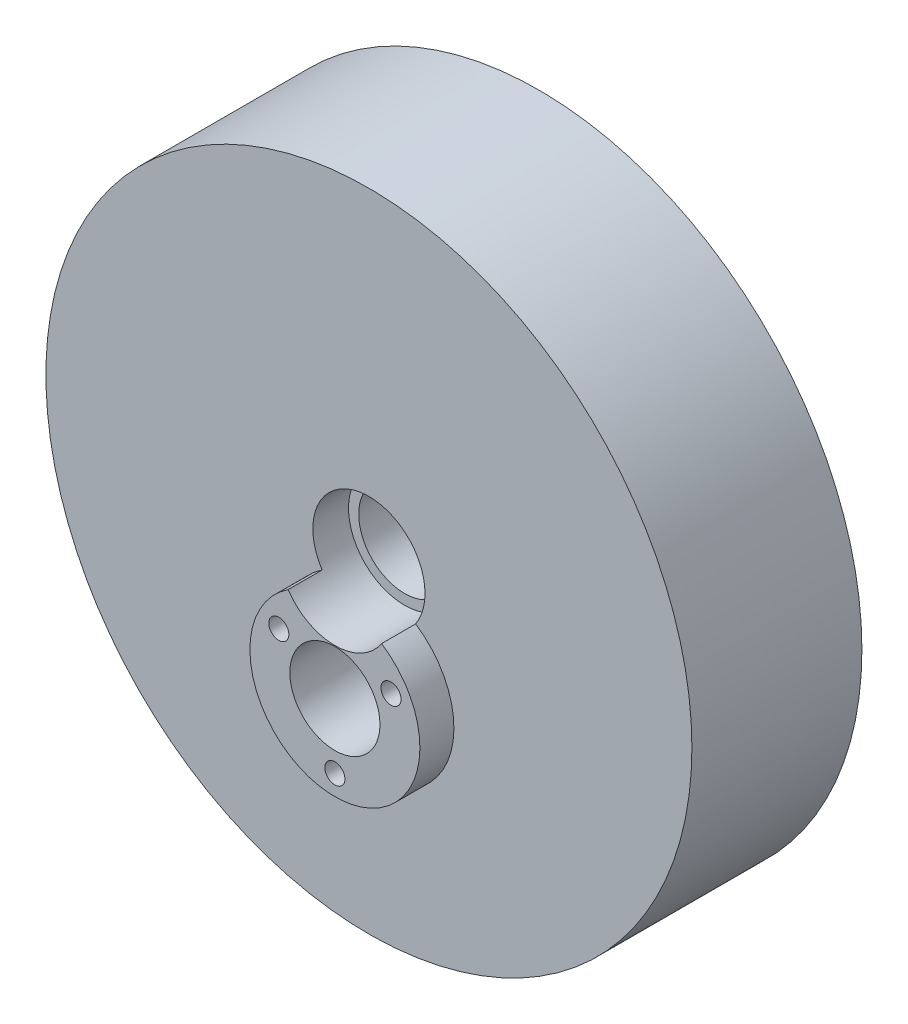
ISO-10303-21;
HEADER;
FILE_DESCRIPTION(('STEP AP214'),'2;1');
FILE_NAME('part.step','',(''),(''),'','','');
FILE_SCHEMA(('AUTOMOTIVE_DESIGN { 1 0 10303 214 1 1 1 1 }'));
ENDSEC;
DATA;
#1=APPLICATION_CONTEXT('core data for automotive mechanical design processes');
#2=APPLICATION_PROTOCOL_DEFINITION('international standard','automotive_design',2000,#1);
#3=PRODUCT_CONTEXT('',#1,'mechanical');
#4=PRODUCT('Part','Part','',(#3));
#5=PRODUCT_RELATED_PRODUCT_CATEGORY('part','',(#4));
#6=PRODUCT_DEFINITION_FORMATION('','',#4);
#7=PRODUCT_DEFINITION_CONTEXT('part definition',#1,'design');
#8=PRODUCT_DEFINITION('design','',#6,#7);
#9=PRODUCT_DEFINITION_SHAPE('','',#8);
#10=(LENGTH_UNIT() NAMED_UNIT(*) SI_UNIT(.MILLI.,.METRE.));
#11=(NAMED_UNIT(*) PLANE_ANGLE_UNIT() SI_UNIT($,.RADIAN.));
#12=(NAMED_UNIT(*) SI_UNIT($,.STERADIAN.) SOLID_ANGLE_UNIT());
#13=UNCERTAINTY_MEASURE_WITH_UNIT(LENGTH_MEASURE(1.E-05),#10,'distance_accuracy_value','');
#14=(GEOMETRIC_REPRESENTATION_CONTEXT(3) GLOBAL_UNCERTAINTY_ASSIGNED_CONTEXT((#13)) GLOBAL_UNIT_ASSIGNED_CONTEXT((#10,
#11,#12)) REPRESENTATION_CONTEXT('',''));
#15=CARTESIAN_POINT('',(0.,0.,0.));
#16=DIRECTION('',(0.,0.,1.));
#17=DIRECTION('',(1.,0.,0.));
#18=AXIS2_PLACEMENT_3D('',#15,#16,#17);
#19=CARTESIAN_POINT('',(0.,0.,25.4));
#20=DIRECTION('',(0.,0.,-1.));
#21=DIRECTION('',(-1.,0.,0.));
#22=AXIS2_PLACEMENT_3D('',#19,#20,#21);
#23=CYLINDRICAL_SURFACE('',#22,48.26);
#24=CARTESIAN_POINT('',(0.,0.,25.4));
#25=DIRECTION('',(0.,0.,1.));
#26=DIRECTION('',(1.,0.,0.));
#27=AXIS2_PLACEMENT_3D('',#24,#25,#26);
#28=CIRCLE('',#27,48.26);
#29=CARTESIAN_POINT('',(48.26,0.,25.4));
#30=VERTEX_POINT('',#29);
#31=EDGE_CURVE('E11',#30,#30,#28,.T.);
#32=ORIENTED_EDGE('',*,*,#31,.F.);
#33=EDGE_LOOP('',(#32));
#34=FACE_BOUND('',#33,.T.);
#35=CARTESIAN_POINT('',(0.,0.,0.));
#36=DIRECTION('',(0.,0.,1.));
#37=DIRECTION('',(1.,0.,0.));
#38=AXIS2_PLACEMENT_3D('',#35,#36,#37);
#39=CIRCLE('',#38,48.26);
#40=CARTESIAN_POINT('',(48.26,0.,0.));
#41=VERTEX_POINT('',#40);
#42=EDGE_CURVE('E47',#41,#41,#39,.T.);
#43=ORIENTED_EDGE('',*,*,#42,.T.);
#44=EDGE_LOOP('',(#43));
#45=FACE_BOUND('',#44,.T.);
#46=ADVANCED_FACE('F39',(#34,#45),#23,.T.);
#47=CARTESIAN_POINT('',(0.,0.,25.4));
#48=DIRECTION('',(0.,0.,1.));
#49=DIRECTION('',(1.,0.,0.));
#50=AXIS2_PLACEMENT_3D('',#47,#48,#49);
#51=PLANE('',#50);
#52=CARTESIAN_POINT('',(0.,-15.24,25.4));
#53=DIRECTION('',(0.,0.,1.));
#54=DIRECTION('',(1.,0.,0.));
#55=AXIS2_PLACEMENT_3D('',#52,#53,#54);
#56=CIRCLE('',#55,12.7);
#57=CARTESIAN_POINT('',(-6.98496119433665,-4.63338333333333,25.4));
#58=VERTEX_POINT('',#57);
#59=CARTESIAN_POINT('',(6.98496119433665,-4.63338333333333,25.4));
#60=VERTEX_POINT('',#59);
#61=EDGE_CURVE('E54',#58,#60,#56,.T.);
#62=ORIENTED_EDGE('',*,*,#61,.F.);
#63=CARTESIAN_POINT('',(0.,0.,25.4));
#64=DIRECTION('',(0.,0.,1.));
#65=DIRECTION('',(1.,0.,0.));
#66=AXIS2_PLACEMENT_3D('',#63,#64,#65);
#67=CIRCLE('',#66,8.382);
#68=EDGE_CURVE('E66',#60,#58,#67,.T.);
#69=ORIENTED_EDGE('',*,*,#68,.F.);
#70=EDGE_LOOP('',(#62,#69));
#71=FACE_BOUND('',#70,.T.);
#72=ORIENTED_EDGE('',*,*,#31,.T.);
#73=EDGE_LOOP('',(#72));
#74=FACE_BOUND('',#73,.T.);
#75=ADVANCED_FACE('F67',(#71,#74),#51,.T.);
#76=CARTESIAN_POINT('',(0.,0.,0.));
#77=DIRECTION('',(0.,0.,1.));
#78=DIRECTION('',(1.,0.,0.));
#79=AXIS2_PLACEMENT_3D('',#76,#77,#78);
#80=PLANE('',#79);
#81=CARTESIAN_POINT('',(0.,0.,0.));
#82=DIRECTION('',(0.,0.,1.));
#83=DIRECTION('',(1.,0.,0.));
#84=AXIS2_PLACEMENT_3D('',#81,#82,#83);
#85=CIRCLE('',#84,8.382);
#86=CARTESIAN_POINT('',(8.382,0.,0.));
#87=VERTEX_POINT('',#86);
#88=EDGE_CURVE('E240',#87,#87,#85,.T.);
#89=ORIENTED_EDGE('',*,*,#88,.T.);
#90=EDGE_LOOP('',(#89));
#91=FACE_BOUND('',#90,.T.);
#92=CARTESIAN_POINT('',(8.37966180701823,-10.402,0.));
#93=DIRECTION('',(0.,0.,1.));
#94=DIRECTION('',(1.,0.,0.));
#95=AXIS2_PLACEMENT_3D('',#92,#93,#94);
#96=CIRCLE('',#95,1.5);
#97=CARTESIAN_POINT('',(9.87966180701823,-10.402,0.));
#98=VERTEX_POINT('',#97);
#99=EDGE_CURVE('E82',#98,#98,#96,.T.);
#100=ORIENTED_EDGE('',*,*,#99,.T.);
#101=EDGE_LOOP('',(#100));
#102=FACE_BOUND('',#101,.T.);
#103=CARTESIAN_POINT('',(0.,-24.916,0.));
#104=DIRECTION('',(0.,0.,1.));
#105=DIRECTION('',(1.,0.,0.));
#106=AXIS2_PLACEMENT_3D('',#103,#104,#105);
#107=CIRCLE('',#106,1.5);
#108=CARTESIAN_POINT('',(1.5,-24.916,0.));
#109=VERTEX_POINT('',#108);
#110=EDGE_CURVE('E253',#109,#109,#107,.T.);
#111=ORIENTED_EDGE('',*,*,#110,.T.);
#112=EDGE_LOOP('',(#111));
#113=FACE_BOUND('',#112,.T.);
#114=CARTESIAN_POINT('',(-8.37966180701823,-10.402,0.));
#115=DIRECTION('',(0.,0.,1.));
#116=DIRECTION('',(1.,0.,0.));
#117=AXIS2_PLACEMENT_3D('',#114,#115,#116);
#118=CIRCLE('',#117,1.5);
#119=CARTESIAN_POINT('',(-6.87966180701823,-10.402,0.));
#120=VERTEX_POINT('',#119);
#121=EDGE_CURVE('E259',#120,#120,#118,.T.);
#122=ORIENTED_EDGE('',*,*,#121,.T.);
#123=EDGE_LOOP('',(#122));
#124=FACE_BOUND('',#123,.T.);
#125=CARTESIAN_POINT('',(0.,-15.24,0.));
#126=DIRECTION('',(0.,0.,-1.));
#127=DIRECTION('',(-1.,0.,0.));
#128=AXIS2_PLACEMENT_3D('',#125,#126,#127);
#129=CIRCLE('',#128,6.731);
#130=CARTESIAN_POINT('',(-6.731,-15.24,0.));
#131=VERTEX_POINT('',#130);
#132=EDGE_CURVE('E74',#131,#131,#129,.T.);
#133=ORIENTED_EDGE('',*,*,#132,.F.);
#134=EDGE_LOOP('',(#133));
#135=FACE_BOUND('',#134,.T.);
#136=ORIENTED_EDGE('',*,*,#42,.F.);
#137=EDGE_LOOP('',(#136));
#138=FACE_BOUND('',#137,.T.);
#139=ADVANCED_FACE('F97',(#91,#102,#113,#124,#135,#138),#80,.F.);
#140=CARTESIAN_POINT('',(0.,0.,20.066));
#141=DIRECTION('',(0.,0.,1.));
#142=DIRECTION('',(1.,0.,0.));
#143=AXIS2_PLACEMENT_3D('',#140,#141,#142);
#144=CYLINDRICAL_SURFACE('',#143,8.382);
#145=CARTESIAN_POINT('',(0.,0.,20.066));
#146=DIRECTION('',(0.,0.,1.));
#147=DIRECTION('',(1.,0.,0.));
#148=AXIS2_PLACEMENT_3D('',#145,#146,#147);
#149=CIRCLE('',#148,8.382);
#150=CARTESIAN_POINT('',(8.382,0.,20.066));
#151=VERTEX_POINT('',#150);
#152=EDGE_CURVE('E73',#151,#151,#149,.T.);
#153=ORIENTED_EDGE('',*,*,#152,.F.);
#154=EDGE_LOOP('',(#153));
#155=FACE_BOUND('',#154,.T.);
#156=ORIENTED_EDGE('',*,*,#68,.T.);
#157=DIRECTION('',(0.,0.,-1.));
#158=VECTOR('',#157,1.);
#159=CARTESIAN_POINT('',(-6.98496119433665,-4.63338333333333,30.48));
#160=LINE('',#159,#158);
#161=CARTESIAN_POINT('',(-6.98496119433665,-4.63338333333333,30.48));
#162=VERTEX_POINT('',#161);
#163=EDGE_CURVE('E80',#162,#58,#160,.T.);
#164=ORIENTED_EDGE('',*,*,#163,.F.);
#165=CARTESIAN_POINT('',(0.,0.,30.48));
#166=DIRECTION('',(0.,0.,1.));
#167=DIRECTION('',(1.,0.,0.));
#168=AXIS2_PLACEMENT_3D('',#165,#166,#167);
#169=CIRCLE('',#168,8.382);
#170=CARTESIAN_POINT('',(6.98496119433665,-4.63338333333333,30.48));
#171=VERTEX_POINT('',#170);
#172=EDGE_CURVE('E85',#171,#162,#169,.F.);
#173=ORIENTED_EDGE('',*,*,#172,.F.);
#174=DIRECTION('',(0.,0.,-1.));
#175=VECTOR('',#174,1.);
#176=CARTESIAN_POINT('',(6.98496119433665,-4.63338333333333,30.48));
#177=LINE('',#176,#175);
#178=EDGE_CURVE('E78',#171,#60,#177,.T.);
#179=ORIENTED_EDGE('',*,*,#178,.T.);
#180=EDGE_LOOP('',(#156,#164,#173,#179));
#181=FACE_BOUND('',#180,.T.);
#182=ADVANCED_FACE('F84',(#155,#181),#144,.F.);
#183=CARTESIAN_POINT('',(0.,0.,20.066));
#184=DIRECTION('',(0.,0.,1.));
#185=DIRECTION('',(1.,0.,0.));
#186=AXIS2_PLACEMENT_3D('',#183,#184,#185);
#187=PLANE('',#186);
#188=CARTESIAN_POINT('',(0.,0.,20.066));
#189=DIRECTION('',(0.,0.,1.));
#190=DIRECTION('',(1.,0.,0.));
#191=AXIS2_PLACEMENT_3D('',#188,#189,#190);
#192=CIRCLE('',#191,6.858);
#193=CARTESIAN_POINT('',(6.858,0.,20.066));
#194=VERTEX_POINT('',#193);
#195=EDGE_CURVE('E237',#194,#194,#192,.T.);
#196=ORIENTED_EDGE('',*,*,#195,.F.);
#197=EDGE_LOOP('',(#196));
#198=FACE_BOUND('',#197,.T.);
#199=ORIENTED_EDGE('',*,*,#152,.T.);
#200=EDGE_LOOP('',(#199));
#201=FACE_BOUND('',#200,.T.);
#202=ADVANCED_FACE('F104',(#198,#201),#187,.T.);
#203=CARTESIAN_POINT('',(0.,-15.24,25.4));
#204=DIRECTION('',(0.,0.,-1.));
#205=DIRECTION('',(-1.,0.,0.));
#206=AXIS2_PLACEMENT_3D('',#203,#204,#205);
#207=CYLINDRICAL_SURFACE('',#206,6.731);
#208=ORIENTED_EDGE('',*,*,#132,.T.);
#209=EDGE_LOOP('',(#208));
#210=FACE_BOUND('',#209,.T.);
#211=CARTESIAN_POINT('',(0.,-15.24,30.48));
#212=DIRECTION('',(0.,0.,1.));
#213=DIRECTION('',(1.,0.,0.));
#214=AXIS2_PLACEMENT_3D('',#211,#212,#213);
#215=CIRCLE('',#214,6.731);
#216=CARTESIAN_POINT('',(6.731,-15.24,30.48));
#217=VERTEX_POINT('',#216);
#218=EDGE_CURVE('E81',#217,#217,#215,.F.);
#219=ORIENTED_EDGE('',*,*,#218,.F.);
#220=EDGE_LOOP('',(#219));
#221=FACE_BOUND('',#220,.T.);
#222=ADVANCED_FACE('F134',(#210,#221),#207,.F.);
#223=CARTESIAN_POINT('',(0.,-15.24,30.48));
#224=DIRECTION('',(0.,0.,-1.));
#225=DIRECTION('',(-1.,0.,0.));
#226=AXIS2_PLACEMENT_3D('',#223,#224,#225);
#227=CYLINDRICAL_SURFACE('',#226,12.7);
#228=ORIENTED_EDGE('',*,*,#61,.T.);
#229=ORIENTED_EDGE('',*,*,#178,.F.);
#230=CARTESIAN_POINT('',(0.,-15.24,30.48));
#231=DIRECTION('',(0.,0.,1.));
#232=DIRECTION('',(1.,0.,0.));
#233=AXIS2_PLACEMENT_3D('',#230,#231,#232);
#234=CIRCLE('',#233,12.7);
#235=EDGE_CURVE('E62',#162,#171,#234,.T.);
#236=ORIENTED_EDGE('',*,*,#235,.F.);
#237=ORIENTED_EDGE('',*,*,#163,.T.);
#238=EDGE_LOOP('',(#228,#229,#236,#237));
#239=FACE_BOUND('',#238,.T.);
#240=ADVANCED_FACE('F77',(#239),#227,.T.);
#241=CARTESIAN_POINT('',(0.,0.,30.48));
#242=DIRECTION('',(0.,0.,1.));
#243=DIRECTION('',(1.,0.,0.));
#244=AXIS2_PLACEMENT_3D('',#241,#242,#243);
#245=PLANE('',#244);
#246=CARTESIAN_POINT('',(8.37966180701823,-10.402,30.48));
#247=DIRECTION('',(0.,0.,1.));
#248=DIRECTION('',(1.,0.,0.));
#249=AXIS2_PLACEMENT_3D('',#246,#247,#248);
#250=CIRCLE('',#249,1.5);
#251=CARTESIAN_POINT('',(9.87966180701823,-10.402,30.48));
#252=VERTEX_POINT('',#251);
#253=EDGE_CURVE('E250',#252,#252,#250,.T.);
#254=ORIENTED_EDGE('',*,*,#253,.F.);
#255=EDGE_LOOP('',(#254));
#256=FACE_BOUND('',#255,.T.);
#257=CARTESIAN_POINT('',(0.,-24.916,30.48));
#258=DIRECTION('',(0.,0.,1.));
#259=DIRECTION('',(1.,0.,0.));
#260=AXIS2_PLACEMENT_3D('',#257,#258,#259);
#261=CIRCLE('',#260,1.5);
#262=CARTESIAN_POINT('',(1.5,-24.916,30.48));
#263=VERTEX_POINT('',#262);
#264=EDGE_CURVE('E256',#263,#263,#261,.T.);
#265=ORIENTED_EDGE('',*,*,#264,.F.);
#266=EDGE_LOOP('',(#265));
#267=FACE_BOUND('',#266,.T.);
#268=CARTESIAN_POINT('',(-8.37966180701823,-10.402,30.48));
#269=DIRECTION('',(0.,0.,1.));
#270=DIRECTION('',(1.,0.,0.));
#271=AXIS2_PLACEMENT_3D('',#268,#269,#270);
#272=CIRCLE('',#271,1.5);
#273=CARTESIAN_POINT('',(-6.87966180701823,-10.402,30.48));
#274=VERTEX_POINT('',#273);
#275=EDGE_CURVE('E246',#274,#274,#272,.T.);
#276=ORIENTED_EDGE('',*,*,#275,.F.);
#277=EDGE_LOOP('',(#276));
#278=FACE_BOUND('',#277,.T.);
#279=ORIENTED_EDGE('',*,*,#218,.T.);
#280=EDGE_LOOP('',(#279));
#281=FACE_BOUND('',#280,.T.);
#282=ORIENTED_EDGE('',*,*,#172,.T.);
#283=ORIENTED_EDGE('',*,*,#235,.T.);
#284=EDGE_LOOP('',(#282,#283));
#285=FACE_BOUND('',#284,.T.);
#286=ADVANCED_FACE('F148',(#256,#267,#278,#281,#285),#245,.T.);
#287=CARTESIAN_POINT('',(-8.37966180701823,-10.402,0.));
#288=DIRECTION('',(0.,0.,1.));
#289=DIRECTION('',(1.,0.,0.));
#290=AXIS2_PLACEMENT_3D('',#287,#288,#289);
#291=CYLINDRICAL_SURFACE('',#290,1.5);
#292=ORIENTED_EDGE('',*,*,#121,.F.);
#293=EDGE_LOOP('',(#292));
#294=FACE_BOUND('',#293,.T.);
#295=ORIENTED_EDGE('',*,*,#275,.T.);
#296=EDGE_LOOP('',(#295));
#297=FACE_BOUND('',#296,.T.);
#298=ADVANCED_FACE('F157',(#294,#297),#291,.F.);
#299=CARTESIAN_POINT('',(0.,-24.916,0.));
#300=DIRECTION('',(0.,0.,1.));
#301=DIRECTION('',(1.,0.,0.));
#302=AXIS2_PLACEMENT_3D('',#299,#300,#301);
#303=CYLINDRICAL_SURFACE('',#302,1.5);
#304=ORIENTED_EDGE('',*,*,#110,.F.);
#305=EDGE_LOOP('',(#304));
#306=FACE_BOUND('',#305,.T.);
#307=ORIENTED_EDGE('',*,*,#264,.T.);
#308=EDGE_LOOP('',(#307));
#309=FACE_BOUND('',#308,.T.);
#310=ADVANCED_FACE('F167',(#306,#309),#303,.F.);
#311=CARTESIAN_POINT('',(8.37966180701823,-10.402,0.));
#312=DIRECTION('',(0.,0.,1.));
#313=DIRECTION('',(1.,0.,0.));
#314=AXIS2_PLACEMENT_3D('',#311,#312,#313);
#315=CYLINDRICAL_SURFACE('',#314,1.5);
#316=ORIENTED_EDGE('',*,*,#99,.F.);
#317=EDGE_LOOP('',(#316));
#318=FACE_BOUND('',#317,.T.);
#319=ORIENTED_EDGE('',*,*,#253,.T.);
#320=EDGE_LOOP('',(#319));
#321=FACE_BOUND('',#320,.T.);
#322=ADVANCED_FACE('F177',(#318,#321),#315,.F.);
#323=CARTESIAN_POINT('',(0.,0.,5.334));
#324=DIRECTION('',(0.,0.,-1.));
#325=DIRECTION('',(-1.,0.,0.));
#326=AXIS2_PLACEMENT_3D('',#323,#324,#325);
#327=CYLINDRICAL_SURFACE('',#326,8.382);
#328=CARTESIAN_POINT('',(0.,0.,5.334));
#329=DIRECTION('',(0.,0.,1.));
#330=DIRECTION('',(1.,0.,0.));
#331=AXIS2_PLACEMENT_3D('',#328,#329,#330);
#332=CIRCLE('',#331,8.382);
#333=CARTESIAN_POINT('',(8.382,0.,5.334));
#334=VERTEX_POINT('',#333);
#335=EDGE_CURVE('E242',#334,#334,#332,.T.);
#336=ORIENTED_EDGE('',*,*,#335,.T.);
#337=EDGE_LOOP('',(#336));
#338=FACE_BOUND('',#337,.T.);
#339=ORIENTED_EDGE('',*,*,#88,.F.);
#340=EDGE_LOOP('',(#339));
#341=FACE_BOUND('',#340,.T.);
#342=ADVANCED_FACE('F186',(#338,#341),#327,.F.);
#343=CARTESIAN_POINT('',(0.,0.,5.334));
#344=DIRECTION('',(0.,0.,-1.));
#345=DIRECTION('',(1.,0.,0.));
#346=AXIS2_PLACEMENT_3D('',#343,#344,#345);
#347=PLANE('',#346);
#348=CARTESIAN_POINT('',(0.,0.,5.334));
#349=DIRECTION('',(0.,0.,-1.));
#350=DIRECTION('',(-1.,0.,0.));
#351=AXIS2_PLACEMENT_3D('',#348,#349,#350);
#352=CIRCLE('',#351,6.858);
#353=CARTESIAN_POINT('',(-6.858,0.,5.334));
#354=VERTEX_POINT('',#353);
#355=EDGE_CURVE('E42',#354,#354,#352,.T.);
#356=ORIENTED_EDGE('',*,*,#355,.F.);
#357=EDGE_LOOP('',(#356));
#358=FACE_BOUND('',#357,.T.);
#359=ORIENTED_EDGE('',*,*,#335,.F.);
#360=EDGE_LOOP('',(#359));
#361=FACE_BOUND('',#360,.T.);
#362=ADVANCED_FACE('F201',(#358,#361),#347,.T.);
#363=CARTESIAN_POINT('',(0.,0.,0.));
#364=DIRECTION('',(0.,0.,1.));
#365=DIRECTION('',(1.,0.,0.));
#366=AXIS2_PLACEMENT_3D('',#363,#364,#365);
#367=CYLINDRICAL_SURFACE('',#366,6.858);
#368=ORIENTED_EDGE('',*,*,#195,.T.);
#369=EDGE_LOOP('',(#368));
#370=FACE_BOUND('',#369,.T.);
#371=ORIENTED_EDGE('',*,*,#355,.T.);
#372=EDGE_LOOP('',(#371));
#373=FACE_BOUND('',#372,.T.);
#374=ADVANCED_FACE('F220',(#370,#373),#367,.F.);
#375=CLOSED_SHELL('',(#46,#75,#139,#182,#202,#222,#240,#286,#298,#310,#322,#342,#362,#374));
#376=MANIFOLD_SOLID_BREP('B2',#375);
#377=ADVANCED_BREP_SHAPE_REPRESENTATION('',(#18,#376),#14);
#378=SHAPE_DEFINITION_REPRESENTATION(#9,#377);
ENDSEC;
END-ISO-10303-21;
